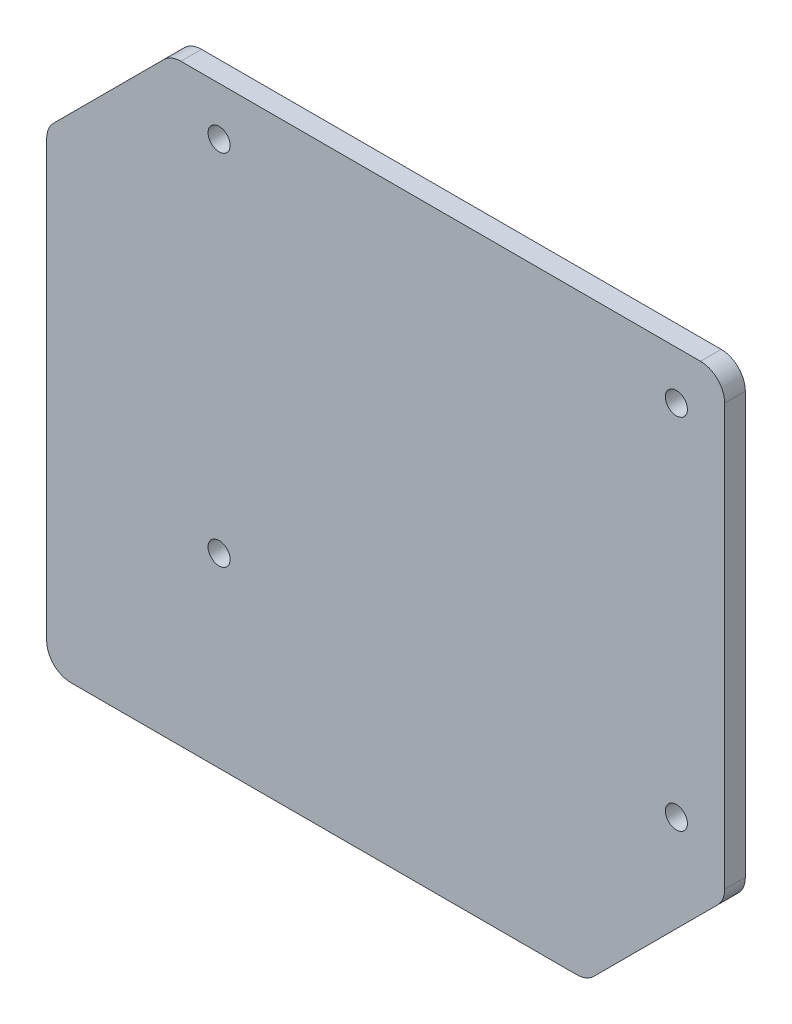
ISO-10303-21;
HEADER;
FILE_DESCRIPTION(('STEP AP214'),'2;1');
FILE_NAME('part.step','',(''),(''),'','','');
FILE_SCHEMA(('AUTOMOTIVE_DESIGN { 1 0 10303 214 1 1 1 1 }'));
ENDSEC;
DATA;
#1=APPLICATION_CONTEXT('core data for automotive mechanical design processes');
#2=APPLICATION_PROTOCOL_DEFINITION('international standard','automotive_design',2000,#1);
#3=PRODUCT_CONTEXT('',#1,'mechanical');
#4=PRODUCT('Part','Part','',(#3));
#5=PRODUCT_RELATED_PRODUCT_CATEGORY('part','',(#4));
#6=PRODUCT_DEFINITION_FORMATION('','',#4);
#7=PRODUCT_DEFINITION_CONTEXT('part definition',#1,'design');
#8=PRODUCT_DEFINITION('design','',#6,#7);
#9=PRODUCT_DEFINITION_SHAPE('','',#8);
#10=(LENGTH_UNIT() NAMED_UNIT(*) SI_UNIT(.MILLI.,.METRE.));
#11=(NAMED_UNIT(*) PLANE_ANGLE_UNIT() SI_UNIT($,.RADIAN.));
#12=(NAMED_UNIT(*) SI_UNIT($,.STERADIAN.) SOLID_ANGLE_UNIT());
#13=UNCERTAINTY_MEASURE_WITH_UNIT(LENGTH_MEASURE(1.E-05),#10,'distance_accuracy_value','');
#14=(GEOMETRIC_REPRESENTATION_CONTEXT(3) GLOBAL_UNCERTAINTY_ASSIGNED_CONTEXT((#13)) GLOBAL_UNIT_ASSIGNED_CONTEXT((#10,
#11,#12)) REPRESENTATION_CONTEXT('',''));
#15=CARTESIAN_POINT('',(0.,0.,0.));
#16=DIRECTION('',(0.,0.,1.));
#17=DIRECTION('',(1.,0.,0.));
#18=AXIS2_PLACEMENT_3D('',#15,#16,#17);
#19=CARTESIAN_POINT('',(40.1499999999999,-40.15,3.));
#20=DIRECTION('',(-0.707106781186546,0.707106781186548,0.));
#21=DIRECTION('',(-0.707106781186549,-0.707106781186546,0.));
#22=AXIS2_PLACEMENT_3D('',#19,#20,#21);
#23=PLANE('',#22);
#24=DIRECTION('',(0.707106781186549,0.707106781186546,0.));
#25=VECTOR('',#24,1.);
#26=CARTESIAN_POINT('',(40.1499999999999,-40.15,0.));
#27=LINE('',#26,#25);
#28=CARTESIAN_POINT('',(61.325126265847,-18.9748737341529,0.));
#29=VERTEX_POINT('',#28);
#30=CARTESIAN_POINT('',(79.2748737341529,-1.02512626584707,0.));
#31=VERTEX_POINT('',#30);
#32=EDGE_CURVE('E153',#29,#31,#27,.T.);
#33=ORIENTED_EDGE('',*,*,#32,.T.);
#34=DIRECTION('',(0.,0.,-1.));
#35=VECTOR('',#34,1.);
#36=CARTESIAN_POINT('',(79.2748737341529,-1.02512626584707,3.));
#37=LINE('',#36,#35);
#38=CARTESIAN_POINT('',(79.2748737341529,-1.02512626584707,3.));
#39=VERTEX_POINT('',#38);
#40=EDGE_CURVE('E130',#31,#39,#37,.F.);
#41=ORIENTED_EDGE('',*,*,#40,.T.);
#42=DIRECTION('',(0.707106781186549,0.707106781186546,0.));
#43=VECTOR('',#42,1.);
#44=CARTESIAN_POINT('',(40.1499999999999,-40.15,3.));
#45=LINE('',#44,#43);
#46=CARTESIAN_POINT('',(61.325126265847,-18.9748737341529,3.));
#47=VERTEX_POINT('',#46);
#48=EDGE_CURVE('E168',#47,#39,#45,.T.);
#49=ORIENTED_EDGE('',*,*,#48,.F.);
#50=DIRECTION('',(0.,0.,-1.));
#51=VECTOR('',#50,1.);
#52=CARTESIAN_POINT('',(61.325126265847,-18.9748737341529,3.));
#53=LINE('',#52,#51);
#54=EDGE_CURVE('E135',#47,#29,#53,.T.);
#55=ORIENTED_EDGE('',*,*,#54,.T.);
#56=EDGE_LOOP('',(#33,#41,#49,#55));
#57=FACE_BOUND('',#56,.T.);
#58=ADVANCED_FACE('F34',(#57),#23,.F.);
#59=CARTESIAN_POINT('',(80.3,0.,3.));
#60=DIRECTION('',(-1.,0.,0.));
#61=DIRECTION('',(0.,0.,1.));
#62=AXIS2_PLACEMENT_3D('',#59,#60,#61);
#63=PLANE('',#62);
#64=DIRECTION('',(0.,1.,0.));
#65=VECTOR('',#64,1.);
#66=CARTESIAN_POINT('',(80.3,0.,3.));
#67=LINE('',#66,#65);
#68=CARTESIAN_POINT('',(80.3,1.44974746830586,3.));
#69=VERTEX_POINT('',#68);
#70=CARTESIAN_POINT('',(80.3,62.5,3.));
#71=VERTEX_POINT('',#70);
#72=EDGE_CURVE('E145',#69,#71,#67,.T.);
#73=ORIENTED_EDGE('',*,*,#72,.F.);
#74=DIRECTION('',(0.,0.,-1.));
#75=VECTOR('',#74,1.);
#76=CARTESIAN_POINT('',(80.3,1.44974746830586,3.));
#77=LINE('',#76,#75);
#78=CARTESIAN_POINT('',(80.3,1.44974746830586,0.));
#79=VERTEX_POINT('',#78);
#80=EDGE_CURVE('E129',#69,#79,#77,.T.);
#81=ORIENTED_EDGE('',*,*,#80,.T.);
#82=DIRECTION('',(0.,1.,0.));
#83=VECTOR('',#82,1.);
#84=CARTESIAN_POINT('',(80.3,0.,0.));
#85=LINE('',#84,#83);
#86=CARTESIAN_POINT('',(80.3,62.5,0.));
#87=VERTEX_POINT('',#86);
#88=EDGE_CURVE('E142',#79,#87,#85,.T.);
#89=ORIENTED_EDGE('',*,*,#88,.T.);
#90=DIRECTION('',(0.,0.,-1.));
#91=VECTOR('',#90,1.);
#92=CARTESIAN_POINT('',(80.3,62.5,3.));
#93=LINE('',#92,#91);
#94=EDGE_CURVE('E147',#87,#71,#93,.F.);
#95=ORIENTED_EDGE('',*,*,#94,.T.);
#96=EDGE_LOOP('',(#73,#81,#89,#95));
#97=FACE_BOUND('',#96,.T.);
#98=ADVANCED_FACE('F141',(#97),#63,.F.);
#99=CARTESIAN_POINT('',(0.,66.,3.));
#100=DIRECTION('',(0.,1.,0.));
#101=DIRECTION('',(0.,0.,1.));
#102=AXIS2_PLACEMENT_3D('',#99,#100,#101);
#103=PLANE('',#102);
#104=DIRECTION('',(1.,0.,0.));
#105=VECTOR('',#104,1.);
#106=CARTESIAN_POINT('',(0.,66.,3.));
#107=LINE('',#106,#105);
#108=CARTESIAN_POINT('',(1.44974746830583,66.,3.));
#109=VERTEX_POINT('',#108);
#110=CARTESIAN_POINT('',(76.8,66.,3.));
#111=VERTEX_POINT('',#110);
#112=EDGE_CURVE('E211',#109,#111,#107,.T.);
#113=ORIENTED_EDGE('',*,*,#112,.T.);
#114=DIRECTION('',(0.,0.,-1.));
#115=VECTOR('',#114,1.);
#116=CARTESIAN_POINT('',(76.8,66.,0.));
#117=LINE('',#116,#115);
#118=CARTESIAN_POINT('',(76.8,66.,0.));
#119=VERTEX_POINT('',#118);
#120=EDGE_CURVE('E11',#111,#119,#117,.T.);
#121=ORIENTED_EDGE('',*,*,#120,.T.);
#122=DIRECTION('',(1.,0.,0.));
#123=VECTOR('',#122,1.);
#124=CARTESIAN_POINT('',(0.,66.,0.));
#125=LINE('',#124,#123);
#126=CARTESIAN_POINT('',(1.44974746830583,66.,0.));
#127=VERTEX_POINT('',#126);
#128=EDGE_CURVE('E152',#127,#119,#125,.T.);
#129=ORIENTED_EDGE('',*,*,#128,.F.);
#130=DIRECTION('',(0.,0.,-1.));
#131=VECTOR('',#130,1.);
#132=CARTESIAN_POINT('',(1.44974746830583,66.,3.));
#133=LINE('',#132,#131);
#134=EDGE_CURVE('E42',#127,#109,#133,.F.);
#135=ORIENTED_EDGE('',*,*,#134,.T.);
#136=EDGE_LOOP('',(#113,#121,#129,#135));
#137=FACE_BOUND('',#136,.T.);
#138=ADVANCED_FACE('F210',(#137),#103,.T.);
#139=CARTESIAN_POINT('',(-33.,33.0000000000001,3.));
#140=DIRECTION('',(0.707106781186546,-0.707106781186548,0.));
#141=DIRECTION('',(0.707106781186549,0.707106781186546,0.));
#142=AXIS2_PLACEMENT_3D('',#139,#140,#141);
#143=PLANE('',#142);
#144=DIRECTION('',(-0.707106781186549,-0.707106781186546,0.));
#145=VECTOR('',#144,1.);
#146=CARTESIAN_POINT('',(-33.,33.0000000000001,0.));
#147=LINE('',#146,#145);
#148=CARTESIAN_POINT('',(-1.02512626584708,64.9748737341529,0.));
#149=VERTEX_POINT('',#148);
#150=CARTESIAN_POINT('',(-16.9748737341529,49.0251262658471,0.));
#151=VERTEX_POINT('',#150);
#152=EDGE_CURVE('E155',#149,#151,#147,.T.);
#153=ORIENTED_EDGE('',*,*,#152,.T.);
#154=DIRECTION('',(0.,0.,-1.));
#155=VECTOR('',#154,1.);
#156=CARTESIAN_POINT('',(-16.9748737341529,49.0251262658471,3.));
#157=LINE('',#156,#155);
#158=CARTESIAN_POINT('',(-16.9748737341529,49.0251262658471,3.));
#159=VERTEX_POINT('',#158);
#160=EDGE_CURVE('E204',#151,#159,#157,.F.);
#161=ORIENTED_EDGE('',*,*,#160,.T.);
#162=DIRECTION('',(-0.707106781186549,-0.707106781186546,0.));
#163=VECTOR('',#162,1.);
#164=CARTESIAN_POINT('',(-33.,33.0000000000001,3.));
#165=LINE('',#164,#163);
#166=CARTESIAN_POINT('',(-1.02512626584708,64.9748737341529,3.));
#167=VERTEX_POINT('',#166);
#168=EDGE_CURVE('E220',#167,#159,#165,.T.);
#169=ORIENTED_EDGE('',*,*,#168,.F.);
#170=DIRECTION('',(0.,0.,-1.));
#171=VECTOR('',#170,1.);
#172=CARTESIAN_POINT('',(-1.02512626584708,64.9748737341529,0.));
#173=LINE('',#172,#171);
#174=EDGE_CURVE('E201',#167,#149,#173,.T.);
#175=ORIENTED_EDGE('',*,*,#174,.T.);
#176=EDGE_LOOP('',(#153,#161,#169,#175));
#177=FACE_BOUND('',#176,.T.);
#178=ADVANCED_FACE('F225',(#177),#143,.F.);
#179=CARTESIAN_POINT('',(-18.,0.,3.));
#180=DIRECTION('',(1.,0.,0.));
#181=DIRECTION('',(0.,1.,0.));
#182=AXIS2_PLACEMENT_3D('',#179,#180,#181);
#183=PLANE('',#182);
#184=DIRECTION('',(0.,-1.,0.));
#185=VECTOR('',#184,1.);
#186=CARTESIAN_POINT('',(-18.,0.,0.));
#187=LINE('',#186,#185);
#188=CARTESIAN_POINT('',(-18.,46.5502525316942,0.));
#189=VERTEX_POINT('',#188);
#190=CARTESIAN_POINT('',(-18.,-16.5,0.));
#191=VERTEX_POINT('',#190);
#192=EDGE_CURVE('E163',#189,#191,#187,.T.);
#193=ORIENTED_EDGE('',*,*,#192,.T.);
#194=DIRECTION('',(0.,0.,-1.));
#195=VECTOR('',#194,1.);
#196=CARTESIAN_POINT('',(-18.,-16.5,3.));
#197=LINE('',#196,#195);
#198=CARTESIAN_POINT('',(-18.,-16.5,3.));
#199=VERTEX_POINT('',#198);
#200=EDGE_CURVE('E199',#191,#199,#197,.F.);
#201=ORIENTED_EDGE('',*,*,#200,.T.);
#202=DIRECTION('',(0.,-1.,0.));
#203=VECTOR('',#202,1.);
#204=CARTESIAN_POINT('',(-18.,0.,3.));
#205=LINE('',#204,#203);
#206=CARTESIAN_POINT('',(-18.,46.5502525316942,3.));
#207=VERTEX_POINT('',#206);
#208=EDGE_CURVE('E236',#207,#199,#205,.T.);
#209=ORIENTED_EDGE('',*,*,#208,.F.);
#210=DIRECTION('',(0.,0.,-1.));
#211=VECTOR('',#210,1.);
#212=CARTESIAN_POINT('',(-18.,46.5502525316942,3.));
#213=LINE('',#212,#211);
#214=EDGE_CURVE('E196',#207,#189,#213,.T.);
#215=ORIENTED_EDGE('',*,*,#214,.T.);
#216=EDGE_LOOP('',(#193,#201,#209,#215));
#217=FACE_BOUND('',#216,.T.);
#218=ADVANCED_FACE('F234',(#217),#183,.F.);
#219=CARTESIAN_POINT('',(0.,-20.,3.));
#220=DIRECTION('',(0.,1.,0.));
#221=DIRECTION('',(0.,0.,1.));
#222=AXIS2_PLACEMENT_3D('',#219,#220,#221);
#223=PLANE('',#222);
#224=DIRECTION('',(1.,0.,0.));
#225=VECTOR('',#224,1.);
#226=CARTESIAN_POINT('',(0.,-20.,0.));
#227=LINE('',#226,#225);
#228=CARTESIAN_POINT('',(-14.5,-20.,0.));
#229=VERTEX_POINT('',#228);
#230=CARTESIAN_POINT('',(58.8502525316941,-20.,0.));
#231=VERTEX_POINT('',#230);
#232=EDGE_CURVE('E166',#229,#231,#227,.T.);
#233=ORIENTED_EDGE('',*,*,#232,.T.);
#234=DIRECTION('',(0.,0.,-1.));
#235=VECTOR('',#234,1.);
#236=CARTESIAN_POINT('',(58.8502525316941,-20.,3.));
#237=LINE('',#236,#235);
#238=CARTESIAN_POINT('',(58.8502525316941,-20.,3.));
#239=VERTEX_POINT('',#238);
#240=EDGE_CURVE('E49',#231,#239,#237,.F.);
#241=ORIENTED_EDGE('',*,*,#240,.T.);
#242=DIRECTION('',(1.,0.,0.));
#243=VECTOR('',#242,1.);
#244=CARTESIAN_POINT('',(0.,-20.,3.));
#245=LINE('',#244,#243);
#246=CARTESIAN_POINT('',(-14.5,-20.,3.));
#247=VERTEX_POINT('',#246);
#248=EDGE_CURVE('E169',#247,#239,#245,.T.);
#249=ORIENTED_EDGE('',*,*,#248,.F.);
#250=DIRECTION('',(0.,0.,-1.));
#251=VECTOR('',#250,1.);
#252=CARTESIAN_POINT('',(-14.5,-20.,3.));
#253=LINE('',#252,#251);
#254=EDGE_CURVE('E192',#247,#229,#253,.T.);
#255=ORIENTED_EDGE('',*,*,#254,.T.);
#256=EDGE_LOOP('',(#233,#241,#249,#255));
#257=FACE_BOUND('',#256,.T.);
#258=ADVANCED_FACE('F270',(#257),#223,.F.);
#259=CARTESIAN_POINT('',(0.,0.,3.));
#260=DIRECTION('',(0.,0.,1.));
#261=DIRECTION('',(1.,0.,0.));
#262=AXIS2_PLACEMENT_3D('',#259,#260,#261);
#263=PLANE('',#262);
#264=CARTESIAN_POINT('',(6.99999999999999,59.,3.));
#265=DIRECTION('',(0.,0.,1.));
#266=DIRECTION('',(1.,0.,0.));
#267=AXIS2_PLACEMENT_3D('',#264,#265,#266);
#268=CIRCLE('',#267,1.59999999999999);
#269=CARTESIAN_POINT('',(8.59999999999998,59.,3.));
#270=VERTEX_POINT('',#269);
#271=EDGE_CURVE('E262',#270,#270,#268,.T.);
#272=ORIENTED_EDGE('',*,*,#271,.F.);
#273=EDGE_LOOP('',(#272));
#274=FACE_BOUND('',#273,.T.);
#275=CARTESIAN_POINT('',(73.3,59.,3.));
#276=DIRECTION('',(0.,0.,1.));
#277=DIRECTION('',(1.,0.,0.));
#278=AXIS2_PLACEMENT_3D('',#275,#276,#277);
#279=CIRCLE('',#278,1.59999999999999);
#280=CARTESIAN_POINT('',(74.9,59.,3.));
#281=VERTEX_POINT('',#280);
#282=EDGE_CURVE('E256',#281,#281,#279,.T.);
#283=ORIENTED_EDGE('',*,*,#282,.F.);
#284=EDGE_LOOP('',(#283));
#285=FACE_BOUND('',#284,.T.);
#286=CARTESIAN_POINT('',(73.3,7.00000000000001,3.));
#287=DIRECTION('',(0.,0.,1.));
#288=DIRECTION('',(1.,0.,0.));
#289=AXIS2_PLACEMENT_3D('',#286,#287,#288);
#290=CIRCLE('',#289,1.59999999999999);
#291=CARTESIAN_POINT('',(74.9,7.00000000000001,3.));
#292=VERTEX_POINT('',#291);
#293=EDGE_CURVE('E250',#292,#292,#290,.T.);
#294=ORIENTED_EDGE('',*,*,#293,.F.);
#295=EDGE_LOOP('',(#294));
#296=FACE_BOUND('',#295,.T.);
#297=CARTESIAN_POINT('',(6.99999999999999,7.00000000000001,3.));
#298=DIRECTION('',(0.,0.,1.));
#299=DIRECTION('',(1.,0.,0.));
#300=AXIS2_PLACEMENT_3D('',#297,#298,#299);
#301=CIRCLE('',#300,1.59999999999999);
#302=CARTESIAN_POINT('',(8.59999999999998,7.00000000000001,3.));
#303=VERTEX_POINT('',#302);
#304=EDGE_CURVE('E244',#303,#303,#301,.T.);
#305=ORIENTED_EDGE('',*,*,#304,.F.);
#306=EDGE_LOOP('',(#305));
#307=FACE_BOUND('',#306,.T.);
#308=ORIENTED_EDGE('',*,*,#48,.T.);
#309=CARTESIAN_POINT('',(76.8,1.44974746830586,3.));
#310=DIRECTION('',(0.,0.,1.));
#311=DIRECTION('',(1.,0.,0.));
#312=AXIS2_PLACEMENT_3D('',#309,#310,#311);
#313=CIRCLE('',#312,3.5);
#314=EDGE_CURVE('E190',#39,#69,#313,.T.);
#315=ORIENTED_EDGE('',*,*,#314,.T.);
#316=ORIENTED_EDGE('',*,*,#72,.T.);
#317=CARTESIAN_POINT('',(76.8,62.5,3.));
#318=DIRECTION('',(0.,0.,1.));
#319=DIRECTION('',(1.,0.,0.));
#320=AXIS2_PLACEMENT_3D('',#317,#318,#319);
#321=CIRCLE('',#320,3.5);
#322=EDGE_CURVE('E183',#71,#111,#321,.T.);
#323=ORIENTED_EDGE('',*,*,#322,.T.);
#324=ORIENTED_EDGE('',*,*,#112,.F.);
#325=CARTESIAN_POINT('',(1.44974746830583,62.5,3.));
#326=DIRECTION('',(0.,0.,1.));
#327=DIRECTION('',(1.,0.,0.));
#328=AXIS2_PLACEMENT_3D('',#325,#326,#327);
#329=CIRCLE('',#328,3.5);
#330=EDGE_CURVE('E181',#109,#167,#329,.T.);
#331=ORIENTED_EDGE('',*,*,#330,.T.);
#332=ORIENTED_EDGE('',*,*,#168,.T.);
#333=CARTESIAN_POINT('',(-14.5,46.5502525316942,3.));
#334=DIRECTION('',(0.,0.,1.));
#335=DIRECTION('',(1.,0.,0.));
#336=AXIS2_PLACEMENT_3D('',#333,#334,#335);
#337=CIRCLE('',#336,3.5);
#338=EDGE_CURVE('E185',#159,#207,#337,.T.);
#339=ORIENTED_EDGE('',*,*,#338,.T.);
#340=ORIENTED_EDGE('',*,*,#208,.T.);
#341=CARTESIAN_POINT('',(-14.5,-16.5,3.));
#342=DIRECTION('',(0.,0.,1.));
#343=DIRECTION('',(1.,0.,0.));
#344=AXIS2_PLACEMENT_3D('',#341,#342,#343);
#345=CIRCLE('',#344,3.5);
#346=EDGE_CURVE('E56',#199,#247,#345,.T.);
#347=ORIENTED_EDGE('',*,*,#346,.T.);
#348=ORIENTED_EDGE('',*,*,#248,.T.);
#349=CARTESIAN_POINT('',(58.8502525316941,-16.5,3.));
#350=DIRECTION('',(0.,0.,1.));
#351=DIRECTION('',(1.,0.,0.));
#352=AXIS2_PLACEMENT_3D('',#349,#350,#351);
#353=CIRCLE('',#352,3.5);
#354=EDGE_CURVE('E188',#239,#47,#353,.T.);
#355=ORIENTED_EDGE('',*,*,#354,.T.);
#356=EDGE_LOOP('',(#308,#315,#316,#323,#324,#331,#332,#339,#340,#347,#348,#355));
#357=FACE_BOUND('',#356,.T.);
#358=ADVANCED_FACE('F216',(#274,#285,#296,#307,#357),#263,.T.);
#359=CARTESIAN_POINT('',(0.,0.,0.));
#360=DIRECTION('',(0.,0.,1.));
#361=DIRECTION('',(1.,0.,0.));
#362=AXIS2_PLACEMENT_3D('',#359,#360,#361);
#363=PLANE('',#362);
#364=CARTESIAN_POINT('',(6.99999999999999,59.,0.));
#365=DIRECTION('',(0.,0.,1.));
#366=DIRECTION('',(1.,0.,0.));
#367=AXIS2_PLACEMENT_3D('',#364,#365,#366);
#368=CIRCLE('',#367,1.6);
#369=CARTESIAN_POINT('',(8.59999999999999,59.,0.));
#370=VERTEX_POINT('',#369);
#371=EDGE_CURVE('E259',#370,#370,#368,.T.);
#372=ORIENTED_EDGE('',*,*,#371,.T.);
#373=EDGE_LOOP('',(#372));
#374=FACE_BOUND('',#373,.T.);
#375=CARTESIAN_POINT('',(73.3,59.,0.));
#376=DIRECTION('',(0.,0.,1.));
#377=DIRECTION('',(1.,0.,0.));
#378=AXIS2_PLACEMENT_3D('',#375,#376,#377);
#379=CIRCLE('',#378,1.6);
#380=CARTESIAN_POINT('',(74.9,59.,0.));
#381=VERTEX_POINT('',#380);
#382=EDGE_CURVE('E253',#381,#381,#379,.T.);
#383=ORIENTED_EDGE('',*,*,#382,.T.);
#384=EDGE_LOOP('',(#383));
#385=FACE_BOUND('',#384,.T.);
#386=CARTESIAN_POINT('',(73.3,7.00000000000001,0.));
#387=DIRECTION('',(0.,0.,1.));
#388=DIRECTION('',(1.,0.,0.));
#389=AXIS2_PLACEMENT_3D('',#386,#387,#388);
#390=CIRCLE('',#389,1.6);
#391=CARTESIAN_POINT('',(74.9,7.00000000000001,0.));
#392=VERTEX_POINT('',#391);
#393=EDGE_CURVE('E247',#392,#392,#390,.T.);
#394=ORIENTED_EDGE('',*,*,#393,.T.);
#395=EDGE_LOOP('',(#394));
#396=FACE_BOUND('',#395,.T.);
#397=CARTESIAN_POINT('',(6.99999999999999,7.00000000000001,0.));
#398=DIRECTION('',(0.,0.,1.));
#399=DIRECTION('',(1.,0.,0.));
#400=AXIS2_PLACEMENT_3D('',#397,#398,#399);
#401=CIRCLE('',#400,1.6);
#402=CARTESIAN_POINT('',(8.59999999999999,7.00000000000001,0.));
#403=VERTEX_POINT('',#402);
#404=EDGE_CURVE('E157',#403,#403,#401,.T.);
#405=ORIENTED_EDGE('',*,*,#404,.T.);
#406=EDGE_LOOP('',(#405));
#407=FACE_BOUND('',#406,.T.);
#408=ORIENTED_EDGE('',*,*,#88,.F.);
#409=CARTESIAN_POINT('',(76.8,1.44974746830586,0.));
#410=DIRECTION('',(0.,0.,1.));
#411=DIRECTION('',(1.,0.,0.));
#412=AXIS2_PLACEMENT_3D('',#409,#410,#411);
#413=CIRCLE('',#412,3.5);
#414=EDGE_CURVE('E125',#79,#31,#413,.F.);
#415=ORIENTED_EDGE('',*,*,#414,.T.);
#416=ORIENTED_EDGE('',*,*,#32,.F.);
#417=CARTESIAN_POINT('',(58.8502525316941,-16.5,0.));
#418=DIRECTION('',(0.,0.,1.));
#419=DIRECTION('',(1.,0.,0.));
#420=AXIS2_PLACEMENT_3D('',#417,#418,#419);
#421=CIRCLE('',#420,3.5);
#422=EDGE_CURVE('E136',#29,#231,#421,.F.);
#423=ORIENTED_EDGE('',*,*,#422,.T.);
#424=ORIENTED_EDGE('',*,*,#232,.F.);
#425=CARTESIAN_POINT('',(-14.5,-16.5,0.));
#426=DIRECTION('',(0.,0.,1.));
#427=DIRECTION('',(1.,0.,0.));
#428=AXIS2_PLACEMENT_3D('',#425,#426,#427);
#429=CIRCLE('',#428,3.5);
#430=EDGE_CURVE('E175',#229,#191,#429,.F.);
#431=ORIENTED_EDGE('',*,*,#430,.T.);
#432=ORIENTED_EDGE('',*,*,#192,.F.);
#433=CARTESIAN_POINT('',(-14.5,46.5502525316942,0.));
#434=DIRECTION('',(0.,0.,1.));
#435=DIRECTION('',(1.,0.,0.));
#436=AXIS2_PLACEMENT_3D('',#433,#434,#435);
#437=CIRCLE('',#436,3.5);
#438=EDGE_CURVE('E173',#189,#151,#437,.F.);
#439=ORIENTED_EDGE('',*,*,#438,.T.);
#440=ORIENTED_EDGE('',*,*,#152,.F.);
#441=CARTESIAN_POINT('',(1.44974746830583,62.5,0.));
#442=DIRECTION('',(0.,0.,1.));
#443=DIRECTION('',(1.,0.,0.));
#444=AXIS2_PLACEMENT_3D('',#441,#442,#443);
#445=CIRCLE('',#444,3.5);
#446=EDGE_CURVE('E146',#149,#127,#445,.F.);
#447=ORIENTED_EDGE('',*,*,#446,.T.);
#448=ORIENTED_EDGE('',*,*,#128,.T.);
#449=CARTESIAN_POINT('',(76.8,62.5,0.));
#450=DIRECTION('',(0.,0.,1.));
#451=DIRECTION('',(1.,0.,0.));
#452=AXIS2_PLACEMENT_3D('',#449,#450,#451);
#453=CIRCLE('',#452,3.5);
#454=EDGE_CURVE('E151',#119,#87,#453,.F.);
#455=ORIENTED_EDGE('',*,*,#454,.T.);
#456=EDGE_LOOP('',(#408,#415,#416,#423,#424,#431,#432,#439,#440,#447,#448,#455));
#457=FACE_BOUND('',#456,.T.);
#458=ADVANCED_FACE('F149',(#374,#385,#396,#407,#457),#363,.F.);
#459=CARTESIAN_POINT('',(76.8,1.44974746830586,3.));
#460=DIRECTION('',(0.,0.,-1.));
#461=DIRECTION('',(-1.,0.,0.));
#462=AXIS2_PLACEMENT_3D('',#459,#460,#461);
#463=CYLINDRICAL_SURFACE('',#462,3.5);
#464=ORIENTED_EDGE('',*,*,#314,.F.);
#465=ORIENTED_EDGE('',*,*,#40,.F.);
#466=ORIENTED_EDGE('',*,*,#414,.F.);
#467=ORIENTED_EDGE('',*,*,#80,.F.);
#468=EDGE_LOOP('',(#464,#465,#466,#467));
#469=FACE_BOUND('',#468,.T.);
#470=ADVANCED_FACE('F128',(#469),#463,.T.);
#471=CARTESIAN_POINT('',(58.8502525316941,-16.5,3.));
#472=DIRECTION('',(0.,0.,-1.));
#473=DIRECTION('',(-1.,0.,0.));
#474=AXIS2_PLACEMENT_3D('',#471,#472,#473);
#475=CYLINDRICAL_SURFACE('',#474,3.5);
#476=ORIENTED_EDGE('',*,*,#354,.F.);
#477=ORIENTED_EDGE('',*,*,#240,.F.);
#478=ORIENTED_EDGE('',*,*,#422,.F.);
#479=ORIENTED_EDGE('',*,*,#54,.F.);
#480=EDGE_LOOP('',(#476,#477,#478,#479));
#481=FACE_BOUND('',#480,.T.);
#482=ADVANCED_FACE('F303',(#481),#475,.T.);
#483=CARTESIAN_POINT('',(-14.5,-16.5,3.));
#484=DIRECTION('',(0.,0.,-1.));
#485=DIRECTION('',(-1.,0.,0.));
#486=AXIS2_PLACEMENT_3D('',#483,#484,#485);
#487=CYLINDRICAL_SURFACE('',#486,3.5);
#488=ORIENTED_EDGE('',*,*,#346,.F.);
#489=ORIENTED_EDGE('',*,*,#200,.F.);
#490=ORIENTED_EDGE('',*,*,#430,.F.);
#491=ORIENTED_EDGE('',*,*,#254,.F.);
#492=EDGE_LOOP('',(#488,#489,#490,#491));
#493=FACE_BOUND('',#492,.T.);
#494=ADVANCED_FACE('F306',(#493),#487,.T.);
#495=CARTESIAN_POINT('',(-14.5,46.5502525316942,3.));
#496=DIRECTION('',(0.,0.,-1.));
#497=DIRECTION('',(-1.,0.,0.));
#498=AXIS2_PLACEMENT_3D('',#495,#496,#497);
#499=CYLINDRICAL_SURFACE('',#498,3.5);
#500=ORIENTED_EDGE('',*,*,#338,.F.);
#501=ORIENTED_EDGE('',*,*,#160,.F.);
#502=ORIENTED_EDGE('',*,*,#438,.F.);
#503=ORIENTED_EDGE('',*,*,#214,.F.);
#504=EDGE_LOOP('',(#500,#501,#502,#503));
#505=FACE_BOUND('',#504,.T.);
#506=ADVANCED_FACE('F231',(#505),#499,.T.);
#507=CARTESIAN_POINT('',(76.8,62.5,3.));
#508=DIRECTION('',(0.,0.,1.));
#509=DIRECTION('',(1.,0.,0.));
#510=AXIS2_PLACEMENT_3D('',#507,#508,#509);
#511=CYLINDRICAL_SURFACE('',#510,3.5);
#512=ORIENTED_EDGE('',*,*,#322,.F.);
#513=ORIENTED_EDGE('',*,*,#94,.F.);
#514=ORIENTED_EDGE('',*,*,#454,.F.);
#515=ORIENTED_EDGE('',*,*,#120,.F.);
#516=EDGE_LOOP('',(#512,#513,#514,#515));
#517=FACE_BOUND('',#516,.T.);
#518=ADVANCED_FACE('F290',(#517),#511,.T.);
#519=CARTESIAN_POINT('',(1.44974746830583,62.5,3.));
#520=DIRECTION('',(0.,0.,1.));
#521=DIRECTION('',(1.,0.,0.));
#522=AXIS2_PLACEMENT_3D('',#519,#520,#521);
#523=CYLINDRICAL_SURFACE('',#522,3.5);
#524=ORIENTED_EDGE('',*,*,#330,.F.);
#525=ORIENTED_EDGE('',*,*,#134,.F.);
#526=ORIENTED_EDGE('',*,*,#446,.F.);
#527=ORIENTED_EDGE('',*,*,#174,.F.);
#528=EDGE_LOOP('',(#524,#525,#526,#527));
#529=FACE_BOUND('',#528,.T.);
#530=ADVANCED_FACE('F36',(#529),#523,.T.);
#531=CARTESIAN_POINT('',(6.99999999999999,7.00000000000001,3.));
#532=DIRECTION('',(0.,0.,1.));
#533=DIRECTION('',(1.,0.,0.));
#534=AXIS2_PLACEMENT_3D('',#531,#532,#533);
#535=CYLINDRICAL_SURFACE('',#534,1.59999999999999);
#536=ORIENTED_EDGE('',*,*,#404,.F.);
#537=EDGE_LOOP('',(#536));
#538=FACE_BOUND('',#537,.T.);
#539=ORIENTED_EDGE('',*,*,#304,.T.);
#540=EDGE_LOOP('',(#539));
#541=FACE_BOUND('',#540,.T.);
#542=ADVANCED_FACE('F278',(#538,#541),#535,.F.);
#543=CARTESIAN_POINT('',(73.3,7.00000000000001,3.));
#544=DIRECTION('',(0.,0.,1.));
#545=DIRECTION('',(1.,0.,0.));
#546=AXIS2_PLACEMENT_3D('',#543,#544,#545);
#547=CYLINDRICAL_SURFACE('',#546,1.6);
#548=ORIENTED_EDGE('',*,*,#393,.F.);
#549=EDGE_LOOP('',(#548));
#550=FACE_BOUND('',#549,.T.);
#551=ORIENTED_EDGE('',*,*,#293,.T.);
#552=EDGE_LOOP('',(#551));
#553=FACE_BOUND('',#552,.T.);
#554=ADVANCED_FACE('F280',(#550,#553),#547,.F.);
#555=CARTESIAN_POINT('',(73.3,59.,3.));
#556=DIRECTION('',(0.,0.,1.));
#557=DIRECTION('',(1.,0.,0.));
#558=AXIS2_PLACEMENT_3D('',#555,#556,#557);
#559=CYLINDRICAL_SURFACE('',#558,1.6);
#560=ORIENTED_EDGE('',*,*,#382,.F.);
#561=EDGE_LOOP('',(#560));
#562=FACE_BOUND('',#561,.T.);
#563=ORIENTED_EDGE('',*,*,#282,.T.);
#564=EDGE_LOOP('',(#563));
#565=FACE_BOUND('',#564,.T.);
#566=ADVANCED_FACE('F287',(#562,#565),#559,.F.);
#567=CARTESIAN_POINT('',(6.99999999999999,59.,3.));
#568=DIRECTION('',(0.,0.,1.));
#569=DIRECTION('',(1.,0.,0.));
#570=AXIS2_PLACEMENT_3D('',#567,#568,#569);
#571=CYLINDRICAL_SURFACE('',#570,1.59999999999999);
#572=ORIENTED_EDGE('',*,*,#371,.F.);
#573=EDGE_LOOP('',(#572));
#574=FACE_BOUND('',#573,.T.);
#575=ORIENTED_EDGE('',*,*,#271,.T.);
#576=EDGE_LOOP('',(#575));
#577=FACE_BOUND('',#576,.T.);
#578=ADVANCED_FACE('F266',(#574,#577),#571,.F.);
#579=CLOSED_SHELL('',(#58,#98,#138,#178,#218,#258,#358,#458,#470,#482,#494,#506,#518,#530,#542,
#554,#566,#578));
#580=MANIFOLD_SOLID_BREP('B2',#579);
#581=ADVANCED_BREP_SHAPE_REPRESENTATION('',(#18,#580),#14);
#582=SHAPE_DEFINITION_REPRESENTATION(#9,#581);
ENDSEC;
END-ISO-10303-21;
